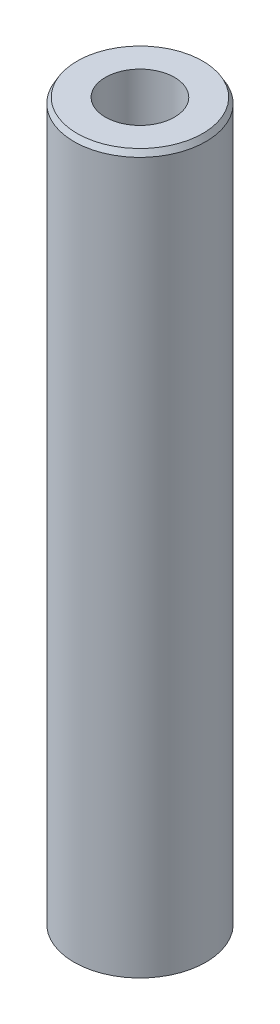
ISO-10303-21;
HEADER;
FILE_DESCRIPTION(('STEP AP214'),'2;1');
FILE_NAME('part.step','',(''),(''),'','','');
FILE_SCHEMA(('AUTOMOTIVE_DESIGN { 1 0 10303 214 1 1 1 1 }'));
ENDSEC;
DATA;
#1=APPLICATION_CONTEXT('core data for automotive mechanical design processes');
#2=APPLICATION_PROTOCOL_DEFINITION('international standard','automotive_design',2000,#1);
#3=PRODUCT_CONTEXT('',#1,'mechanical');
#4=PRODUCT('Part','Part','',(#3));
#5=PRODUCT_RELATED_PRODUCT_CATEGORY('part','',(#4));
#6=PRODUCT_DEFINITION_FORMATION('','',#4);
#7=PRODUCT_DEFINITION_CONTEXT('part definition',#1,'design');
#8=PRODUCT_DEFINITION('design','',#6,#7);
#9=PRODUCT_DEFINITION_SHAPE('','',#8);
#10=(LENGTH_UNIT() NAMED_UNIT(*) SI_UNIT(.MILLI.,.METRE.));
#11=(NAMED_UNIT(*) PLANE_ANGLE_UNIT() SI_UNIT($,.RADIAN.));
#12=(NAMED_UNIT(*) SI_UNIT($,.STERADIAN.) SOLID_ANGLE_UNIT());
#13=UNCERTAINTY_MEASURE_WITH_UNIT(LENGTH_MEASURE(1.E-05),#10,'distance_accuracy_value','');
#14=(GEOMETRIC_REPRESENTATION_CONTEXT(3) GLOBAL_UNCERTAINTY_ASSIGNED_CONTEXT((#13)) GLOBAL_UNIT_ASSIGNED_CONTEXT((#10,
#11,#12)) REPRESENTATION_CONTEXT('',''));
#15=CARTESIAN_POINT('',(0.,0.,0.));
#16=DIRECTION('',(0.,0.,1.));
#17=DIRECTION('',(1.,0.,0.));
#18=AXIS2_PLACEMENT_3D('',#15,#16,#17);
#19=CARTESIAN_POINT('',(0.,600.,0.));
#20=DIRECTION('',(0.,-1.,0.));
#21=DIRECTION('',(0.,0.,-1.));
#22=AXIS2_PLACEMENT_3D('',#19,#20,#21);
#23=CYLINDRICAL_SURFACE('',#22,55.);
#24=CARTESIAN_POINT('',(0.,595.450591691281,0.));
#25=DIRECTION('',(0.,1.,0.));
#26=DIRECTION('',(0.,0.,1.));
#27=AXIS2_PLACEMENT_3D('',#24,#25,#26);
#28=CIRCLE('',#27,55.);
#29=CARTESIAN_POINT('',(0.,595.450591691281,55.));
#30=VERTEX_POINT('',#29);
#31=EDGE_CURVE('E50',#30,#30,#28,.F.);
#32=ORIENTED_EDGE('',*,*,#31,.T.);
#33=EDGE_LOOP('',(#32));
#34=FACE_BOUND('',#33,.T.);
#35=CARTESIAN_POINT('',(0.,2.6266021116923,0.));
#36=DIRECTION('',(0.,1.,0.));
#37=DIRECTION('',(0.,0.,1.));
#38=AXIS2_PLACEMENT_3D('',#35,#36,#37);
#39=CIRCLE('',#38,55.);
#40=CARTESIAN_POINT('',(0.,2.6266021116923,55.));
#41=VERTEX_POINT('',#40);
#42=EDGE_CURVE('E51',#41,#41,#39,.T.);
#43=ORIENTED_EDGE('',*,*,#42,.T.);
#44=EDGE_LOOP('',(#43));
#45=FACE_BOUND('',#44,.T.);
#46=ADVANCED_FACE('F39',(#34,#45),#23,.T.);
#47=CARTESIAN_POINT('',(0.,600.,0.));
#48=DIRECTION('',(0.,1.,0.));
#49=DIRECTION('',(0.,0.,1.));
#50=AXIS2_PLACEMENT_3D('',#47,#48,#49);
#51=PLANE('',#50);
#52=CARTESIAN_POINT('',(0.,600.,0.));
#53=DIRECTION('',(0.,1.,0.));
#54=DIRECTION('',(0.,0.,1.));
#55=AXIS2_PLACEMENT_3D('',#52,#53,#54);
#56=CIRCLE('',#55,52.3733978883076);
#57=CARTESIAN_POINT('',(0.,600.,52.3733978883076));
#58=VERTEX_POINT('',#57);
#59=EDGE_CURVE('E54',#58,#58,#56,.T.);
#60=ORIENTED_EDGE('',*,*,#59,.T.);
#61=EDGE_LOOP('',(#60));
#62=FACE_BOUND('',#61,.T.);
#63=CARTESIAN_POINT('',(0.,600.,0.));
#64=DIRECTION('',(0.,1.,0.));
#65=DIRECTION('',(0.,0.,1.));
#66=AXIS2_PLACEMENT_3D('',#63,#64,#65);
#67=CIRCLE('',#66,28.8174853619433);
#68=CARTESIAN_POINT('',(0.,600.,28.8174853619433));
#69=VERTEX_POINT('',#68);
#70=EDGE_CURVE('E58',#69,#69,#67,.T.);
#71=ORIENTED_EDGE('',*,*,#70,.F.);
#72=EDGE_LOOP('',(#71));
#73=FACE_BOUND('',#72,.T.);
#74=ADVANCED_FACE('F69',(#62,#73),#51,.T.);
#75=CARTESIAN_POINT('',(0.,0.,0.));
#76=DIRECTION('',(0.,1.,0.));
#77=DIRECTION('',(0.,0.,1.));
#78=AXIS2_PLACEMENT_3D('',#75,#76,#77);
#79=PLANE('',#78);
#80=CARTESIAN_POINT('',(0.,0.,0.));
#81=DIRECTION('',(0.,1.,0.));
#82=DIRECTION('',(0.,0.,1.));
#83=AXIS2_PLACEMENT_3D('',#80,#81,#82);
#84=CIRCLE('',#83,50.4505916912812);
#85=CARTESIAN_POINT('',(0.,0.,50.4505916912812));
#86=VERTEX_POINT('',#85);
#87=EDGE_CURVE('E10',#86,#86,#84,.F.);
#88=ORIENTED_EDGE('',*,*,#87,.T.);
#89=EDGE_LOOP('',(#88));
#90=FACE_BOUND('',#89,.T.);
#91=CARTESIAN_POINT('',(0.,0.,0.));
#92=DIRECTION('',(0.,1.,0.));
#93=DIRECTION('',(0.,0.,1.));
#94=AXIS2_PLACEMENT_3D('',#91,#92,#93);
#95=CIRCLE('',#94,28.8174853619433);
#96=CARTESIAN_POINT('',(0.,0.,28.8174853619433));
#97=VERTEX_POINT('',#96);
#98=EDGE_CURVE('E63',#97,#97,#95,.T.);
#99=ORIENTED_EDGE('',*,*,#98,.T.);
#100=EDGE_LOOP('',(#99));
#101=FACE_BOUND('',#100,.T.);
#102=ADVANCED_FACE('F75',(#90,#101),#79,.F.);
#103=CARTESIAN_POINT('',(0.,600.,0.));
#104=DIRECTION('',(0.,-1.,0.));
#105=DIRECTION('',(0.,0.,-1.));
#106=AXIS2_PLACEMENT_3D('',#103,#104,#105);
#107=CYLINDRICAL_SURFACE('',#106,28.8174853619433);
#108=ORIENTED_EDGE('',*,*,#70,.T.);
#109=EDGE_LOOP('',(#108));
#110=FACE_BOUND('',#109,.T.);
#111=ORIENTED_EDGE('',*,*,#98,.F.);
#112=EDGE_LOOP('',(#111));
#113=FACE_BOUND('',#112,.T.);
#114=ADVANCED_FACE('F70',(#110,#113),#107,.F.);
#115=CARTESIAN_POINT('',(0.,600.,0.));
#116=DIRECTION('',(0.,-1.,0.));
#117=DIRECTION('',(0.,0.,-1.));
#118=AXIS2_PLACEMENT_3D('',#115,#116,#117);
#119=CONICAL_SURFACE('',#118,52.3733978883076,0.523598775598288);
#120=ORIENTED_EDGE('',*,*,#31,.F.);
#121=EDGE_LOOP('',(#120));
#122=FACE_BOUND('',#121,.T.);
#123=ORIENTED_EDGE('',*,*,#59,.F.);
#124=EDGE_LOOP('',(#123));
#125=FACE_BOUND('',#124,.T.);
#126=ADVANCED_FACE('F81',(#122,#125),#119,.T.);
#127=CARTESIAN_POINT('',(0.,2.6266021116923,0.));
#128=DIRECTION('',(0.,1.,0.));
#129=DIRECTION('',(0.,0.,1.));
#130=AXIS2_PLACEMENT_3D('',#127,#128,#129);
#131=CONICAL_SURFACE('',#130,55.,1.0471975511966);
#132=ORIENTED_EDGE('',*,*,#87,.F.);
#133=EDGE_LOOP('',(#132));
#134=FACE_BOUND('',#133,.T.);
#135=ORIENTED_EDGE('',*,*,#42,.F.);
#136=EDGE_LOOP('',(#135));
#137=FACE_BOUND('',#136,.T.);
#138=ADVANCED_FACE('F45',(#134,#137),#131,.T.);
#139=CLOSED_SHELL('',(#46,#74,#102,#114,#126,#138));
#140=MANIFOLD_SOLID_BREP('B2',#139);
#141=ADVANCED_BREP_SHAPE_REPRESENTATION('',(#18,#140),#14);
#142=SHAPE_DEFINITION_REPRESENTATION(#9,#141);
ENDSEC;
END-ISO-10303-21;
